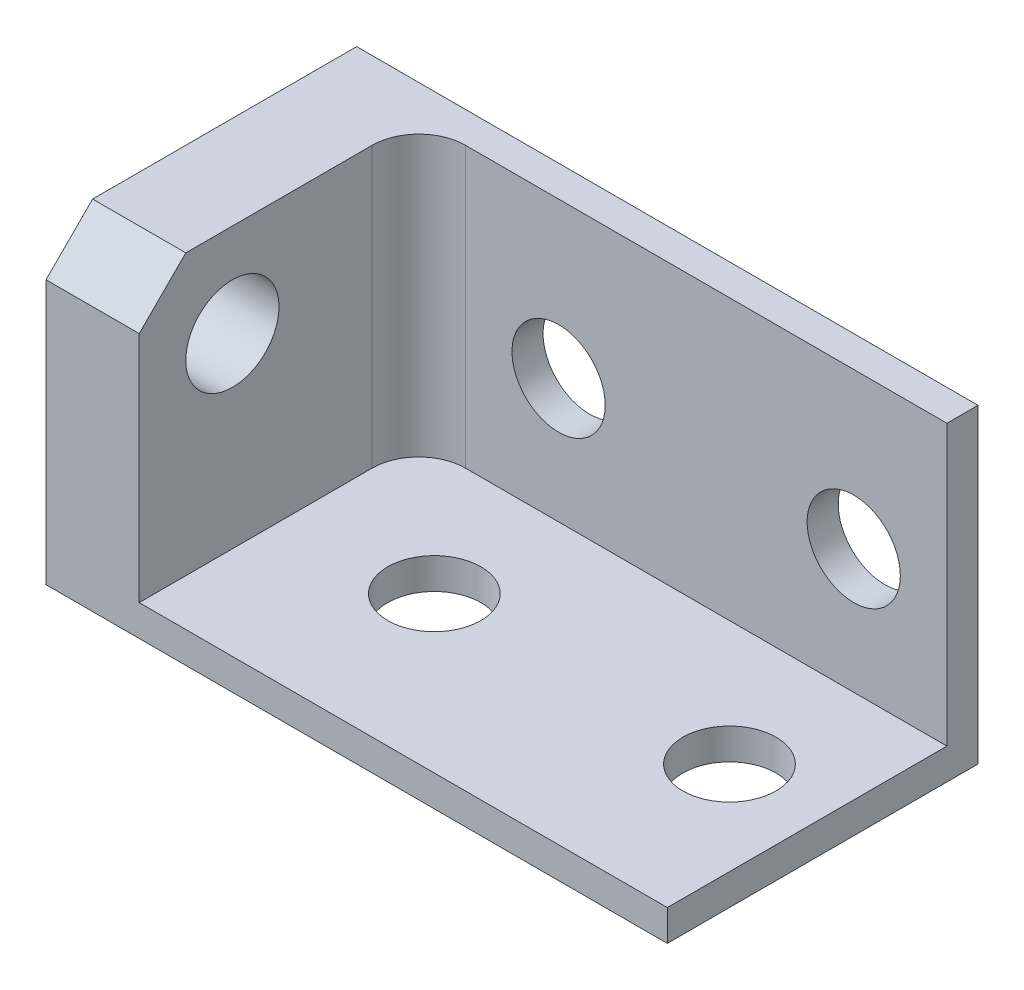
ISO-10303-21;
HEADER;
FILE_DESCRIPTION(('STEP AP214'),'2;1');
FILE_NAME('part.step','',(''),(''),'','','');
FILE_SCHEMA(('AUTOMOTIVE_DESIGN { 1 0 10303 214 1 1 1 1 }'));
ENDSEC;
DATA;
#1=APPLICATION_CONTEXT('core data for automotive mechanical design processes');
#2=APPLICATION_PROTOCOL_DEFINITION('international standard','automotive_design',2000,#1);
#3=PRODUCT_CONTEXT('',#1,'mechanical');
#4=PRODUCT('Part','Part','',(#3));
#5=PRODUCT_RELATED_PRODUCT_CATEGORY('part','',(#4));
#6=PRODUCT_DEFINITION_FORMATION('','',#4);
#7=PRODUCT_DEFINITION_CONTEXT('part definition',#1,'design');
#8=PRODUCT_DEFINITION('design','',#6,#7);
#9=PRODUCT_DEFINITION_SHAPE('','',#8);
#10=(LENGTH_UNIT() NAMED_UNIT(*) SI_UNIT(.MILLI.,.METRE.));
#11=(NAMED_UNIT(*) PLANE_ANGLE_UNIT() SI_UNIT($,.RADIAN.));
#12=(NAMED_UNIT(*) SI_UNIT($,.STERADIAN.) SOLID_ANGLE_UNIT());
#13=UNCERTAINTY_MEASURE_WITH_UNIT(LENGTH_MEASURE(1.E-05),#10,'distance_accuracy_value','');
#14=(GEOMETRIC_REPRESENTATION_CONTEXT(3) GLOBAL_UNCERTAINTY_ASSIGNED_CONTEXT((#13)) GLOBAL_UNIT_ASSIGNED_CONTEXT((#10,
#11,#12)) REPRESENTATION_CONTEXT('',''));
#15=CARTESIAN_POINT('',(0.,0.,0.));
#16=DIRECTION('',(0.,0.,1.));
#17=DIRECTION('',(1.,0.,0.));
#18=AXIS2_PLACEMENT_3D('',#15,#16,#17);
#19=CARTESIAN_POINT('',(0.,0.,2.));
#20=DIRECTION('',(0.,0.,1.));
#21=DIRECTION('',(1.,0.,0.));
#22=AXIS2_PLACEMENT_3D('',#19,#20,#21);
#23=PLANE('',#22);
#24=CARTESIAN_POINT('',(-25.,10.,2.));
#25=DIRECTION('',(0.,0.,1.));
#26=DIRECTION('',(1.,0.,0.));
#27=AXIS2_PLACEMENT_3D('',#24,#25,#26);
#28=CIRCLE('',#27,3.);
#29=CARTESIAN_POINT('',(-22.,10.,2.));
#30=VERTEX_POINT('',#29);
#31=EDGE_CURVE('E168',#30,#30,#28,.T.);
#32=ORIENTED_EDGE('',*,*,#31,.F.);
#33=EDGE_LOOP('',(#32));
#34=FACE_BOUND('',#33,.T.);
#35=CARTESIAN_POINT('',(-6.,10.,2.));
#36=DIRECTION('',(0.,0.,1.));
#37=DIRECTION('',(1.,0.,0.));
#38=AXIS2_PLACEMENT_3D('',#35,#36,#37);
#39=CIRCLE('',#38,3.);
#40=CARTESIAN_POINT('',(-3.,10.,2.));
#41=VERTEX_POINT('',#40);
#42=EDGE_CURVE('E164',#41,#41,#39,.T.);
#43=ORIENTED_EDGE('',*,*,#42,.F.);
#44=EDGE_LOOP('',(#43));
#45=FACE_BOUND('',#44,.T.);
#46=DIRECTION('',(-1.,0.,0.));
#47=VECTOR('',#46,1.);
#48=CARTESIAN_POINT('',(0.,20.,2.));
#49=LINE('',#48,#47);
#50=CARTESIAN_POINT('',(0.,20.,2.));
#51=VERTEX_POINT('',#50);
#52=CARTESIAN_POINT('',(-31.,20.,2.));
#53=VERTEX_POINT('',#52);
#54=EDGE_CURVE('E138',#51,#53,#49,.T.);
#55=ORIENTED_EDGE('',*,*,#54,.T.);
#56=DIRECTION('',(0.,-1.,0.));
#57=VECTOR('',#56,1.);
#58=CARTESIAN_POINT('',(-31.,0.,2.));
#59=LINE('',#58,#57);
#60=CARTESIAN_POINT('',(-31.,2.,2.));
#61=VERTEX_POINT('',#60);
#62=EDGE_CURVE('E179',#53,#61,#59,.T.);
#63=ORIENTED_EDGE('',*,*,#62,.T.);
#64=DIRECTION('',(-1.,0.,0.));
#65=VECTOR('',#64,1.);
#66=CARTESIAN_POINT('',(0.,2.,2.));
#67=LINE('',#66,#65);
#68=CARTESIAN_POINT('',(0.,2.,2.));
#69=VERTEX_POINT('',#68);
#70=EDGE_CURVE('E126',#69,#61,#67,.T.);
#71=ORIENTED_EDGE('',*,*,#70,.F.);
#72=DIRECTION('',(0.,1.,0.));
#73=VECTOR('',#72,1.);
#74=CARTESIAN_POINT('',(0.,0.,2.));
#75=LINE('',#74,#73);
#76=EDGE_CURVE('E136',#69,#51,#75,.T.);
#77=ORIENTED_EDGE('',*,*,#76,.T.);
#78=EDGE_LOOP('',(#55,#63,#71,#77));
#79=FACE_BOUND('',#78,.T.);
#80=ADVANCED_FACE('F32',(#34,#45,#79),#23,.T.);
#81=CARTESIAN_POINT('',(0.,2.,20.));
#82=DIRECTION('',(0.,-1.,0.));
#83=DIRECTION('',(1.,0.,0.));
#84=AXIS2_PLACEMENT_3D('',#81,#82,#83);
#85=PLANE('',#84);
#86=CARTESIAN_POINT('',(-6.,2.,10.));
#87=DIRECTION('',(0.,1.,0.));
#88=DIRECTION('',(-1.,0.,0.));
#89=AXIS2_PLACEMENT_3D('',#86,#87,#88);
#90=CIRCLE('',#89,3.);
#91=CARTESIAN_POINT('',(-9.,2.,10.));
#92=VERTEX_POINT('',#91);
#93=EDGE_CURVE('E373',#92,#92,#90,.T.);
#94=ORIENTED_EDGE('',*,*,#93,.F.);
#95=EDGE_LOOP('',(#94));
#96=FACE_BOUND('',#95,.T.);
#97=CARTESIAN_POINT('',(-25.,2.,10.));
#98=DIRECTION('',(0.,1.,0.));
#99=DIRECTION('',(-1.,0.,0.));
#100=AXIS2_PLACEMENT_3D('',#97,#98,#99);
#101=CIRCLE('',#100,3.);
#102=CARTESIAN_POINT('',(-28.,2.,10.));
#103=VERTEX_POINT('',#102);
#104=EDGE_CURVE('E108',#103,#103,#101,.T.);
#105=ORIENTED_EDGE('',*,*,#104,.F.);
#106=EDGE_LOOP('',(#105));
#107=FACE_BOUND('',#106,.T.);
#108=ORIENTED_EDGE('',*,*,#70,.T.);
#109=CARTESIAN_POINT('',(-31.,2.,5.));
#110=DIRECTION('',(0.,-1.,0.));
#111=DIRECTION('',(1.,0.,0.));
#112=AXIS2_PLACEMENT_3D('',#109,#110,#111);
#113=CIRCLE('',#112,3.);
#114=CARTESIAN_POINT('',(-34.,2.,5.));
#115=VERTEX_POINT('',#114);
#116=EDGE_CURVE('E54',#61,#115,#113,.F.);
#117=ORIENTED_EDGE('',*,*,#116,.T.);
#118=DIRECTION('',(0.,0.,-1.));
#119=VECTOR('',#118,1.);
#120=CARTESIAN_POINT('',(-34.,2.,2.));
#121=LINE('',#120,#119);
#122=CARTESIAN_POINT('',(-34.,2.,20.));
#123=VERTEX_POINT('',#122);
#124=EDGE_CURVE('E103',#123,#115,#121,.T.);
#125=ORIENTED_EDGE('',*,*,#124,.F.);
#126=DIRECTION('',(-1.,0.,0.));
#127=VECTOR('',#126,1.);
#128=CARTESIAN_POINT('',(0.,2.,20.));
#129=LINE('',#128,#127);
#130=CARTESIAN_POINT('',(0.,2.,20.));
#131=VERTEX_POINT('',#130);
#132=EDGE_CURVE('E113',#131,#123,#129,.T.);
#133=ORIENTED_EDGE('',*,*,#132,.F.);
#134=DIRECTION('',(0.,0.,-1.));
#135=VECTOR('',#134,1.);
#136=CARTESIAN_POINT('',(0.,2.,20.));
#137=LINE('',#136,#135);
#138=EDGE_CURVE('E131',#131,#69,#137,.T.);
#139=ORIENTED_EDGE('',*,*,#138,.T.);
#140=EDGE_LOOP('',(#108,#117,#125,#133,#139));
#141=FACE_BOUND('',#140,.T.);
#142=ADVANCED_FACE('F111',(#96,#107,#141),#85,.F.);
#143=CARTESIAN_POINT('',(0.,0.,2.));
#144=DIRECTION('',(-1.,0.,0.));
#145=DIRECTION('',(0.,-1.,0.));
#146=AXIS2_PLACEMENT_3D('',#143,#144,#145);
#147=PLANE('',#146);
#148=DIRECTION('',(0.,1.,0.));
#149=VECTOR('',#148,1.);
#150=CARTESIAN_POINT('',(0.,0.,0.));
#151=LINE('',#150,#149);
#152=CARTESIAN_POINT('',(0.,0.,0.));
#153=VERTEX_POINT('',#152);
#154=CARTESIAN_POINT('',(0.,20.,0.));
#155=VERTEX_POINT('',#154);
#156=EDGE_CURVE('E135',#153,#155,#151,.T.);
#157=ORIENTED_EDGE('',*,*,#156,.T.);
#158=DIRECTION('',(0.,0.,-1.));
#159=VECTOR('',#158,1.);
#160=CARTESIAN_POINT('',(0.,20.,2.));
#161=LINE('',#160,#159);
#162=EDGE_CURVE('E158',#51,#155,#161,.T.);
#163=ORIENTED_EDGE('',*,*,#162,.F.);
#164=ORIENTED_EDGE('',*,*,#76,.F.);
#165=ORIENTED_EDGE('',*,*,#138,.F.);
#166=DIRECTION('',(0.,1.,0.));
#167=VECTOR('',#166,1.);
#168=CARTESIAN_POINT('',(0.,0.,20.));
#169=LINE('',#168,#167);
#170=CARTESIAN_POINT('',(0.,0.,20.));
#171=VERTEX_POINT('',#170);
#172=EDGE_CURVE('E120',#171,#131,#169,.T.);
#173=ORIENTED_EDGE('',*,*,#172,.F.);
#174=DIRECTION('',(0.,0.,-1.));
#175=VECTOR('',#174,1.);
#176=CARTESIAN_POINT('',(0.,0.,2.));
#177=LINE('',#176,#175);
#178=EDGE_CURVE('E142',#171,#153,#177,.T.);
#179=ORIENTED_EDGE('',*,*,#178,.T.);
#180=EDGE_LOOP('',(#157,#163,#164,#165,#173,#179));
#181=FACE_BOUND('',#180,.T.);
#182=ADVANCED_FACE('F189',(#181),#147,.F.);
#183=CARTESIAN_POINT('',(0.,20.,2.));
#184=DIRECTION('',(0.,-1.,0.));
#185=DIRECTION('',(1.,0.,0.));
#186=AXIS2_PLACEMENT_3D('',#183,#184,#185);
#187=PLANE('',#186);
#188=DIRECTION('',(0.,0.,-1.));
#189=VECTOR('',#188,1.);
#190=CARTESIAN_POINT('',(-40.,20.,2.));
#191=LINE('',#190,#189);
#192=CARTESIAN_POINT('',(-40.,20.,17.));
#193=VERTEX_POINT('',#192);
#194=CARTESIAN_POINT('',(-40.,20.,0.));
#195=VERTEX_POINT('',#194);
#196=EDGE_CURVE('E156',#193,#195,#191,.T.);
#197=ORIENTED_EDGE('',*,*,#196,.F.);
#198=DIRECTION('',(1.,0.,0.));
#199=VECTOR('',#198,1.);
#200=CARTESIAN_POINT('',(-34.,20.,17.));
#201=LINE('',#200,#199);
#202=CARTESIAN_POINT('',(-34.,20.,17.));
#203=VERTEX_POINT('',#202);
#204=EDGE_CURVE('E161',#193,#203,#201,.T.);
#205=ORIENTED_EDGE('',*,*,#204,.T.);
#206=DIRECTION('',(0.,0.,-1.));
#207=VECTOR('',#206,1.);
#208=CARTESIAN_POINT('',(-34.,20.,2.));
#209=LINE('',#208,#207);
#210=CARTESIAN_POINT('',(-34.,20.,5.));
#211=VERTEX_POINT('',#210);
#212=EDGE_CURVE('E109',#203,#211,#209,.T.);
#213=ORIENTED_EDGE('',*,*,#212,.T.);
#214=CARTESIAN_POINT('',(-31.,20.,5.));
#215=DIRECTION('',(0.,-1.,0.));
#216=DIRECTION('',(1.,0.,0.));
#217=AXIS2_PLACEMENT_3D('',#214,#215,#216);
#218=CIRCLE('',#217,3.);
#219=EDGE_CURVE('E11',#211,#53,#218,.T.);
#220=ORIENTED_EDGE('',*,*,#219,.T.);
#221=ORIENTED_EDGE('',*,*,#54,.F.);
#222=ORIENTED_EDGE('',*,*,#162,.T.);
#223=DIRECTION('',(-1.,0.,0.));
#224=VECTOR('',#223,1.);
#225=CARTESIAN_POINT('',(0.,20.,0.));
#226=LINE('',#225,#224);
#227=EDGE_CURVE('E145',#155,#195,#226,.T.);
#228=ORIENTED_EDGE('',*,*,#227,.T.);
#229=EDGE_LOOP('',(#197,#205,#213,#220,#221,#222,#228));
#230=FACE_BOUND('',#229,.T.);
#231=ADVANCED_FACE('F193',(#230),#187,.F.);
#232=CARTESIAN_POINT('',(-40.,0.,2.));
#233=DIRECTION('',(1.,0.,0.));
#234=DIRECTION('',(0.,0.,-1.));
#235=AXIS2_PLACEMENT_3D('',#232,#233,#234);
#236=PLANE('',#235);
#237=CARTESIAN_POINT('',(-40.,14.,14.));
#238=DIRECTION('',(-1.,0.,0.));
#239=DIRECTION('',(0.,0.,1.));
#240=AXIS2_PLACEMENT_3D('',#237,#238,#239);
#241=CIRCLE('',#240,3.);
#242=CARTESIAN_POINT('',(-40.,14.,17.));
#243=VERTEX_POINT('',#242);
#244=EDGE_CURVE('E171',#243,#243,#241,.T.);
#245=ORIENTED_EDGE('',*,*,#244,.F.);
#246=EDGE_LOOP('',(#245));
#247=FACE_BOUND('',#246,.T.);
#248=DIRECTION('',(0.,-1.,0.));
#249=VECTOR('',#248,1.);
#250=CARTESIAN_POINT('',(-40.,0.,20.));
#251=LINE('',#250,#249);
#252=CARTESIAN_POINT('',(-40.,17.,20.));
#253=VERTEX_POINT('',#252);
#254=CARTESIAN_POINT('',(-40.,0.,20.));
#255=VERTEX_POINT('',#254);
#256=EDGE_CURVE('E122',#253,#255,#251,.T.);
#257=ORIENTED_EDGE('',*,*,#256,.F.);
#258=DIRECTION('',(0.,0.707106781186549,-0.707106781186546));
#259=VECTOR('',#258,1.);
#260=CARTESIAN_POINT('',(-40.,20.,17.));
#261=LINE('',#260,#259);
#262=EDGE_CURVE('E177',#253,#193,#261,.T.);
#263=ORIENTED_EDGE('',*,*,#262,.T.);
#264=ORIENTED_EDGE('',*,*,#196,.T.);
#265=DIRECTION('',(0.,-1.,0.));
#266=VECTOR('',#265,1.);
#267=CARTESIAN_POINT('',(-40.,0.,0.));
#268=LINE('',#267,#266);
#269=CARTESIAN_POINT('',(-40.,0.,0.));
#270=VERTEX_POINT('',#269);
#271=EDGE_CURVE('E148',#195,#270,#268,.T.);
#272=ORIENTED_EDGE('',*,*,#271,.T.);
#273=DIRECTION('',(0.,0.,-1.));
#274=VECTOR('',#273,1.);
#275=CARTESIAN_POINT('',(-40.,0.,2.));
#276=LINE('',#275,#274);
#277=EDGE_CURVE('E153',#255,#270,#276,.T.);
#278=ORIENTED_EDGE('',*,*,#277,.F.);
#279=EDGE_LOOP('',(#257,#263,#264,#272,#278));
#280=FACE_BOUND('',#279,.T.);
#281=ADVANCED_FACE('F220',(#247,#280),#236,.F.);
#282=CARTESIAN_POINT('',(0.,0.,2.));
#283=DIRECTION('',(0.,1.,0.));
#284=DIRECTION('',(0.,0.,1.));
#285=AXIS2_PLACEMENT_3D('',#282,#283,#284);
#286=PLANE('',#285);
#287=CARTESIAN_POINT('',(-25.,0.,10.));
#288=DIRECTION('',(0.,1.,0.));
#289=DIRECTION('',(0.,0.,1.));
#290=AXIS2_PLACEMENT_3D('',#287,#288,#289);
#291=CIRCLE('',#290,3.);
#292=CARTESIAN_POINT('',(-25.,0.,13.));
#293=VERTEX_POINT('',#292);
#294=EDGE_CURVE('E370',#293,#293,#291,.T.);
#295=ORIENTED_EDGE('',*,*,#294,.T.);
#296=EDGE_LOOP('',(#295));
#297=FACE_BOUND('',#296,.T.);
#298=CARTESIAN_POINT('',(-6.,0.,10.));
#299=DIRECTION('',(0.,1.,0.));
#300=DIRECTION('',(0.,0.,1.));
#301=AXIS2_PLACEMENT_3D('',#298,#299,#300);
#302=CIRCLE('',#301,3.);
#303=CARTESIAN_POINT('',(-6.,0.,13.));
#304=VERTEX_POINT('',#303);
#305=EDGE_CURVE('E376',#304,#304,#302,.T.);
#306=ORIENTED_EDGE('',*,*,#305,.T.);
#307=EDGE_LOOP('',(#306));
#308=FACE_BOUND('',#307,.T.);
#309=DIRECTION('',(1.,0.,0.));
#310=VECTOR('',#309,1.);
#311=CARTESIAN_POINT('',(0.,0.,0.));
#312=LINE('',#311,#310);
#313=EDGE_CURVE('E139',#270,#153,#312,.T.);
#314=ORIENTED_EDGE('',*,*,#313,.T.);
#315=ORIENTED_EDGE('',*,*,#178,.F.);
#316=DIRECTION('',(1.,0.,0.));
#317=VECTOR('',#316,1.);
#318=CARTESIAN_POINT('',(0.,0.,20.));
#319=LINE('',#318,#317);
#320=EDGE_CURVE('E124',#255,#171,#319,.T.);
#321=ORIENTED_EDGE('',*,*,#320,.F.);
#322=ORIENTED_EDGE('',*,*,#277,.T.);
#323=EDGE_LOOP('',(#314,#315,#321,#322));
#324=FACE_BOUND('',#323,.T.);
#325=ADVANCED_FACE('F216',(#297,#308,#324),#286,.F.);
#326=CARTESIAN_POINT('',(0.,0.,0.));
#327=DIRECTION('',(0.,0.,1.));
#328=DIRECTION('',(1.,0.,0.));
#329=AXIS2_PLACEMENT_3D('',#326,#327,#328);
#330=PLANE('',#329);
#331=CARTESIAN_POINT('',(-25.,10.,0.));
#332=DIRECTION('',(0.,0.,1.));
#333=DIRECTION('',(1.,0.,0.));
#334=AXIS2_PLACEMENT_3D('',#331,#332,#333);
#335=CIRCLE('',#334,3.);
#336=CARTESIAN_POINT('',(-22.,10.,0.));
#337=VERTEX_POINT('',#336);
#338=EDGE_CURVE('E165',#337,#337,#335,.T.);
#339=ORIENTED_EDGE('',*,*,#338,.T.);
#340=EDGE_LOOP('',(#339));
#341=FACE_BOUND('',#340,.T.);
#342=CARTESIAN_POINT('',(-6.,10.,0.));
#343=DIRECTION('',(0.,0.,1.));
#344=DIRECTION('',(1.,0.,0.));
#345=AXIS2_PLACEMENT_3D('',#342,#343,#344);
#346=CIRCLE('',#345,3.);
#347=CARTESIAN_POINT('',(-3.,10.,0.));
#348=VERTEX_POINT('',#347);
#349=EDGE_CURVE('E133',#348,#348,#346,.T.);
#350=ORIENTED_EDGE('',*,*,#349,.T.);
#351=EDGE_LOOP('',(#350));
#352=FACE_BOUND('',#351,.T.);
#353=ORIENTED_EDGE('',*,*,#156,.F.);
#354=ORIENTED_EDGE('',*,*,#313,.F.);
#355=ORIENTED_EDGE('',*,*,#271,.F.);
#356=ORIENTED_EDGE('',*,*,#227,.F.);
#357=EDGE_LOOP('',(#353,#354,#355,#356));
#358=FACE_BOUND('',#357,.T.);
#359=ADVANCED_FACE('F213',(#341,#352,#358),#330,.F.);
#360=CARTESIAN_POINT('',(0.,0.,20.));
#361=DIRECTION('',(0.,0.,1.));
#362=DIRECTION('',(1.,0.,0.));
#363=AXIS2_PLACEMENT_3D('',#360,#361,#362);
#364=PLANE('',#363);
#365=DIRECTION('',(0.,-1.,0.));
#366=VECTOR('',#365,1.);
#367=CARTESIAN_POINT('',(-34.,20.,20.));
#368=LINE('',#367,#366);
#369=CARTESIAN_POINT('',(-34.,17.,20.));
#370=VERTEX_POINT('',#369);
#371=EDGE_CURVE('E101',#370,#123,#368,.T.);
#372=ORIENTED_EDGE('',*,*,#371,.F.);
#373=DIRECTION('',(-1.,0.,0.));
#374=VECTOR('',#373,1.);
#375=CARTESIAN_POINT('',(-40.,17.,20.));
#376=LINE('',#375,#374);
#377=EDGE_CURVE('E175',#370,#253,#376,.T.);
#378=ORIENTED_EDGE('',*,*,#377,.T.);
#379=ORIENTED_EDGE('',*,*,#256,.T.);
#380=ORIENTED_EDGE('',*,*,#320,.T.);
#381=ORIENTED_EDGE('',*,*,#172,.T.);
#382=ORIENTED_EDGE('',*,*,#132,.T.);
#383=EDGE_LOOP('',(#372,#378,#379,#380,#381,#382));
#384=FACE_BOUND('',#383,.T.);
#385=ADVANCED_FACE('F117',(#384),#364,.T.);
#386=CARTESIAN_POINT('',(-6.,10.,-16.));
#387=DIRECTION('',(0.,0.,1.));
#388=DIRECTION('',(1.,0.,0.));
#389=AXIS2_PLACEMENT_3D('',#386,#387,#388);
#390=CYLINDRICAL_SURFACE('',#389,3.);
#391=ORIENTED_EDGE('',*,*,#42,.T.);
#392=EDGE_LOOP('',(#391));
#393=FACE_BOUND('',#392,.T.);
#394=ORIENTED_EDGE('',*,*,#349,.F.);
#395=EDGE_LOOP('',(#394));
#396=FACE_BOUND('',#395,.T.);
#397=ADVANCED_FACE('F260',(#393,#396),#390,.F.);
#398=CARTESIAN_POINT('',(-25.,10.,-16.));
#399=DIRECTION('',(0.,0.,1.));
#400=DIRECTION('',(1.,0.,0.));
#401=AXIS2_PLACEMENT_3D('',#398,#399,#400);
#402=CYLINDRICAL_SURFACE('',#401,3.);
#403=ORIENTED_EDGE('',*,*,#31,.T.);
#404=EDGE_LOOP('',(#403));
#405=FACE_BOUND('',#404,.T.);
#406=ORIENTED_EDGE('',*,*,#338,.F.);
#407=EDGE_LOOP('',(#406));
#408=FACE_BOUND('',#407,.T.);
#409=ADVANCED_FACE('F266',(#405,#408),#402,.F.);
#410=CARTESIAN_POINT('',(-6.,-16.,10.));
#411=DIRECTION('',(0.,1.,0.));
#412=DIRECTION('',(-1.,0.,0.));
#413=AXIS2_PLACEMENT_3D('',#410,#411,#412);
#414=CYLINDRICAL_SURFACE('',#413,3.);
#415=ORIENTED_EDGE('',*,*,#93,.T.);
#416=EDGE_LOOP('',(#415));
#417=FACE_BOUND('',#416,.T.);
#418=ORIENTED_EDGE('',*,*,#305,.F.);
#419=EDGE_LOOP('',(#418));
#420=FACE_BOUND('',#419,.T.);
#421=ADVANCED_FACE('F273',(#417,#420),#414,.F.);
#422=CARTESIAN_POINT('',(-25.,-16.,10.));
#423=DIRECTION('',(0.,1.,0.));
#424=DIRECTION('',(-1.,0.,0.));
#425=AXIS2_PLACEMENT_3D('',#422,#423,#424);
#426=CYLINDRICAL_SURFACE('',#425,3.);
#427=ORIENTED_EDGE('',*,*,#104,.T.);
#428=EDGE_LOOP('',(#427));
#429=FACE_BOUND('',#428,.T.);
#430=ORIENTED_EDGE('',*,*,#294,.F.);
#431=EDGE_LOOP('',(#430));
#432=FACE_BOUND('',#431,.T.);
#433=ADVANCED_FACE('F280',(#429,#432),#426,.F.);
#434=CARTESIAN_POINT('',(-34.,20.,2.));
#435=DIRECTION('',(-1.,0.,0.));
#436=DIRECTION('',(0.,-1.,0.));
#437=AXIS2_PLACEMENT_3D('',#434,#435,#436);
#438=PLANE('',#437);
#439=CARTESIAN_POINT('',(-34.,14.,14.));
#440=DIRECTION('',(-1.,0.,0.));
#441=DIRECTION('',(0.,-1.,0.));
#442=AXIS2_PLACEMENT_3D('',#439,#440,#441);
#443=CIRCLE('',#442,3.);
#444=CARTESIAN_POINT('',(-34.,11.,14.));
#445=VERTEX_POINT('',#444);
#446=EDGE_CURVE('E115',#445,#445,#443,.T.);
#447=ORIENTED_EDGE('',*,*,#446,.T.);
#448=EDGE_LOOP('',(#447));
#449=FACE_BOUND('',#448,.T.);
#450=ORIENTED_EDGE('',*,*,#124,.T.);
#451=DIRECTION('',(0.,-1.,0.));
#452=VECTOR('',#451,1.);
#453=CARTESIAN_POINT('',(-34.,20.,5.));
#454=LINE('',#453,#452);
#455=EDGE_CURVE('E40',#115,#211,#454,.F.);
#456=ORIENTED_EDGE('',*,*,#455,.T.);
#457=ORIENTED_EDGE('',*,*,#212,.F.);
#458=DIRECTION('',(0.,-0.707106781186549,0.707106781186546));
#459=VECTOR('',#458,1.);
#460=CARTESIAN_POINT('',(-34.,20.,17.));
#461=LINE('',#460,#459);
#462=EDGE_CURVE('E104',#203,#370,#461,.T.);
#463=ORIENTED_EDGE('',*,*,#462,.T.);
#464=ORIENTED_EDGE('',*,*,#371,.T.);
#465=EDGE_LOOP('',(#450,#456,#457,#463,#464));
#466=FACE_BOUND('',#465,.T.);
#467=ADVANCED_FACE('F102',(#449,#466),#438,.F.);
#468=CARTESIAN_POINT('',(-22.,14.,14.));
#469=DIRECTION('',(-1.,0.,0.));
#470=DIRECTION('',(0.,0.,1.));
#471=AXIS2_PLACEMENT_3D('',#468,#469,#470);
#472=CYLINDRICAL_SURFACE('',#471,3.);
#473=ORIENTED_EDGE('',*,*,#244,.T.);
#474=EDGE_LOOP('',(#473));
#475=FACE_BOUND('',#474,.T.);
#476=ORIENTED_EDGE('',*,*,#446,.F.);
#477=EDGE_LOOP('',(#476));
#478=FACE_BOUND('',#477,.T.);
#479=ADVANCED_FACE('F199',(#475,#478),#472,.F.);
#480=CARTESIAN_POINT('',(0.,20.,17.));
#481=DIRECTION('',(0.,0.707106781186546,0.707106781186549));
#482=DIRECTION('',(-1.,0.,0.));
#483=AXIS2_PLACEMENT_3D('',#480,#481,#482);
#484=PLANE('',#483);
#485=ORIENTED_EDGE('',*,*,#262,.F.);
#486=ORIENTED_EDGE('',*,*,#377,.F.);
#487=ORIENTED_EDGE('',*,*,#462,.F.);
#488=ORIENTED_EDGE('',*,*,#204,.F.);
#489=EDGE_LOOP('',(#485,#486,#487,#488));
#490=FACE_BOUND('',#489,.T.);
#491=ADVANCED_FACE('F195',(#490),#484,.T.);
#492=CARTESIAN_POINT('',(-31.,0.,5.));
#493=DIRECTION('',(0.,-1.,0.));
#494=DIRECTION('',(1.,0.,0.));
#495=AXIS2_PLACEMENT_3D('',#492,#493,#494);
#496=CYLINDRICAL_SURFACE('',#495,3.);
#497=ORIENTED_EDGE('',*,*,#219,.F.);
#498=ORIENTED_EDGE('',*,*,#455,.F.);
#499=ORIENTED_EDGE('',*,*,#116,.F.);
#500=ORIENTED_EDGE('',*,*,#62,.F.);
#501=EDGE_LOOP('',(#497,#498,#499,#500));
#502=FACE_BOUND('',#501,.T.);
#503=ADVANCED_FACE('F34',(#502),#496,.F.);
#504=CLOSED_SHELL('',(#80,#142,#182,#231,#281,#325,#359,#385,#397,#409,#421,#433,#467,#479,#491,#503));
#505=MANIFOLD_SOLID_BREP('B2',#504);
#506=ADVANCED_BREP_SHAPE_REPRESENTATION('',(#18,#505),#14);
#507=SHAPE_DEFINITION_REPRESENTATION(#9,#506);
ENDSEC;
END-ISO-10303-21;
